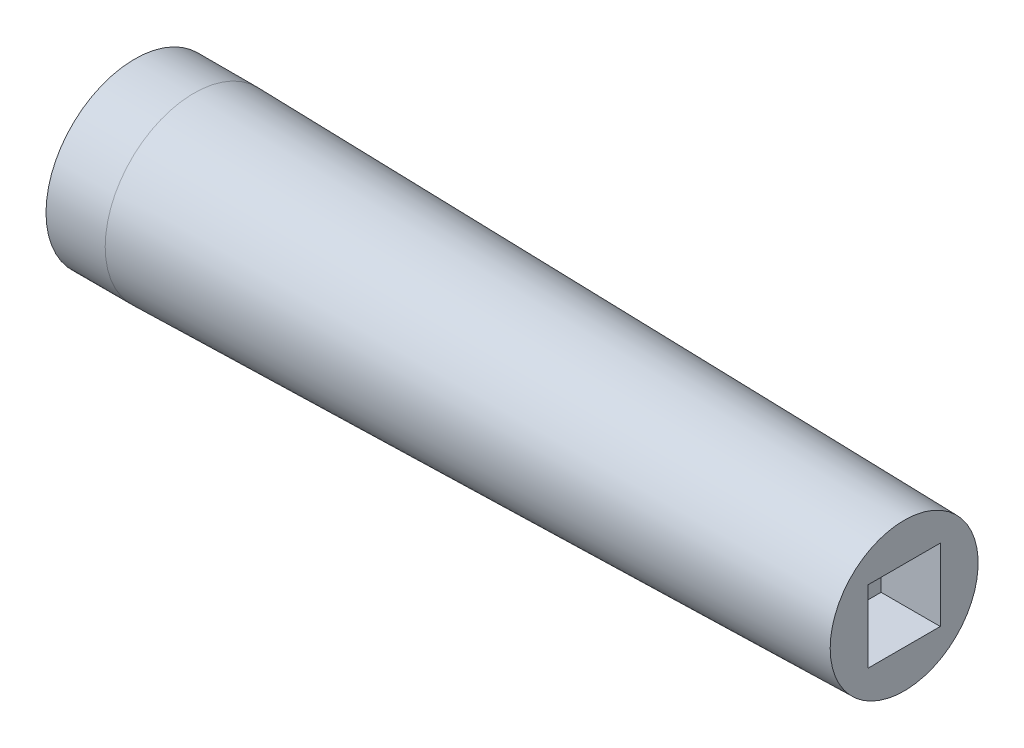
ISO-10303-21;
HEADER;
FILE_DESCRIPTION(('STEP AP214'),'2;1');
FILE_NAME('part.step','',(''),(''),'','','');
FILE_SCHEMA(('AUTOMOTIVE_DESIGN { 1 0 10303 214 1 1 1 1 }'));
ENDSEC;
DATA;
#1=APPLICATION_CONTEXT('core data for automotive mechanical design processes');
#2=APPLICATION_PROTOCOL_DEFINITION('international standard','automotive_design',2000,#1);
#3=PRODUCT_CONTEXT('',#1,'mechanical');
#4=PRODUCT('Part','Part','',(#3));
#5=PRODUCT_RELATED_PRODUCT_CATEGORY('part','',(#4));
#6=PRODUCT_DEFINITION_FORMATION('','',#4);
#7=PRODUCT_DEFINITION_CONTEXT('part definition',#1,'design');
#8=PRODUCT_DEFINITION('design','',#6,#7);
#9=PRODUCT_DEFINITION_SHAPE('','',#8);
#10=(LENGTH_UNIT() NAMED_UNIT(*) SI_UNIT(.MILLI.,.METRE.));
#11=(NAMED_UNIT(*) PLANE_ANGLE_UNIT() SI_UNIT($,.RADIAN.));
#12=(NAMED_UNIT(*) SI_UNIT($,.STERADIAN.) SOLID_ANGLE_UNIT());
#13=UNCERTAINTY_MEASURE_WITH_UNIT(LENGTH_MEASURE(1.E-05),#10,'distance_accuracy_value','');
#14=(GEOMETRIC_REPRESENTATION_CONTEXT(3) GLOBAL_UNCERTAINTY_ASSIGNED_CONTEXT((#13)) GLOBAL_UNIT_ASSIGNED_CONTEXT((#10,
#11,#12)) REPRESENTATION_CONTEXT('',''));
#15=CARTESIAN_POINT('',(0.,0.,0.));
#16=DIRECTION('',(0.,0.,1.));
#17=DIRECTION('',(1.,0.,0.));
#18=AXIS2_PLACEMENT_3D('',#15,#16,#17);
#19=CARTESIAN_POINT('',(0.,19.05,0.));
#20=DIRECTION('',(1.,0.,0.));
#21=DIRECTION('',(0.,0.,-1.));
#22=AXIS2_PLACEMENT_3D('',#19,#20,#21);
#23=PLANE('',#22);
#24=CARTESIAN_POINT('',(0.,0.,0.));
#25=DIRECTION('',(-1.,0.,0.));
#26=DIRECTION('',(0.,0.,1.));
#27=AXIS2_PLACEMENT_3D('',#24,#25,#26);
#28=CIRCLE('',#27,19.05);
#29=CARTESIAN_POINT('',(0.,0.,19.05));
#30=VERTEX_POINT('',#29);
#31=EDGE_CURVE('E108',#30,#30,#28,.T.);
#32=ORIENTED_EDGE('',*,*,#31,.T.);
#33=EDGE_LOOP('',(#32));
#34=FACE_BOUND('',#33,.T.);
#35=ADVANCED_FACE('F33',(#34),#23,.F.);
#36=CARTESIAN_POINT('',(165.1,0.,0.));
#37=DIRECTION('',(-1.,0.,0.));
#38=DIRECTION('',(0.,0.,1.));
#39=AXIS2_PLACEMENT_3D('',#36,#37,#38);
#40=PLANE('',#39);
#41=DIRECTION('',(0.,0.,1.));
#42=VECTOR('',#41,1.);
#43=CARTESIAN_POINT('',(165.1,7.747,7.747));
#44=LINE('',#43,#42);
#45=CARTESIAN_POINT('',(165.1,7.747,-7.747));
#46=VERTEX_POINT('',#45);
#47=CARTESIAN_POINT('',(165.1,7.747,7.747));
#48=VERTEX_POINT('',#47);
#49=EDGE_CURVE('E82',#46,#48,#44,.T.);
#50=ORIENTED_EDGE('',*,*,#49,.F.);
#51=DIRECTION('',(0.,1.,0.));
#52=VECTOR('',#51,1.);
#53=CARTESIAN_POINT('',(165.1,-7.747,-7.747));
#54=LINE('',#53,#52);
#55=CARTESIAN_POINT('',(165.1,-7.747,-7.747));
#56=VERTEX_POINT('',#55);
#57=EDGE_CURVE('E47',#56,#46,#54,.T.);
#58=ORIENTED_EDGE('',*,*,#57,.F.);
#59=DIRECTION('',(0.,0.,-1.));
#60=VECTOR('',#59,1.);
#61=CARTESIAN_POINT('',(165.1,-7.747,7.747));
#62=LINE('',#61,#60);
#63=CARTESIAN_POINT('',(165.1,-7.747,7.747));
#64=VERTEX_POINT('',#63);
#65=EDGE_CURVE('E98',#64,#56,#62,.T.);
#66=ORIENTED_EDGE('',*,*,#65,.F.);
#67=DIRECTION('',(0.,-1.,0.));
#68=VECTOR('',#67,1.);
#69=CARTESIAN_POINT('',(165.1,-7.747,7.747));
#70=LINE('',#69,#68);
#71=EDGE_CURVE('E104',#48,#64,#70,.T.);
#72=ORIENTED_EDGE('',*,*,#71,.F.);
#73=EDGE_LOOP('',(#50,#58,#66,#72));
#74=FACE_BOUND('',#73,.T.);
#75=CARTESIAN_POINT('',(165.1,0.,0.));
#76=DIRECTION('',(-1.,0.,0.));
#77=DIRECTION('',(0.,0.,1.));
#78=AXIS2_PLACEMENT_3D('',#75,#76,#77);
#79=CIRCLE('',#78,15.875);
#80=CARTESIAN_POINT('',(165.1,0.,15.875));
#81=VERTEX_POINT('',#80);
#82=EDGE_CURVE('E11',#81,#81,#79,.T.);
#83=ORIENTED_EDGE('',*,*,#82,.F.);
#84=EDGE_LOOP('',(#83));
#85=FACE_BOUND('',#84,.T.);
#86=ADVANCED_FACE('F120',(#74,#85),#40,.F.);
#87=CARTESIAN_POINT('',(165.1,0.,0.));
#88=DIRECTION('',(-1.,0.,0.));
#89=DIRECTION('',(0.,0.,1.));
#90=AXIS2_PLACEMENT_3D('',#87,#88,#89);
#91=CONICAL_SURFACE('',#90,15.875,0.0208303200362171);
#92=CARTESIAN_POINT('',(12.7,0.,0.));
#93=DIRECTION('',(-1.,0.,0.));
#94=DIRECTION('',(0.,0.,1.));
#95=AXIS2_PLACEMENT_3D('',#92,#93,#94);
#96=CIRCLE('',#95,19.05);
#97=CARTESIAN_POINT('',(12.7,0.,19.05));
#98=VERTEX_POINT('',#97);
#99=EDGE_CURVE('E40',#98,#98,#96,.T.);
#100=ORIENTED_EDGE('',*,*,#99,.F.);
#101=EDGE_LOOP('',(#100));
#102=FACE_BOUND('',#101,.T.);
#103=ORIENTED_EDGE('',*,*,#82,.T.);
#104=EDGE_LOOP('',(#103));
#105=FACE_BOUND('',#104,.T.);
#106=ADVANCED_FACE('F117',(#102,#105),#91,.T.);
#107=CARTESIAN_POINT('',(0.,0.,0.));
#108=DIRECTION('',(-1.,0.,0.));
#109=DIRECTION('',(0.,0.,1.));
#110=AXIS2_PLACEMENT_3D('',#107,#108,#109);
#111=CYLINDRICAL_SURFACE('',#110,19.05);
#112=ORIENTED_EDGE('',*,*,#31,.F.);
#113=EDGE_LOOP('',(#112));
#114=FACE_BOUND('',#113,.T.);
#115=ORIENTED_EDGE('',*,*,#99,.T.);
#116=EDGE_LOOP('',(#115));
#117=FACE_BOUND('',#116,.T.);
#118=ADVANCED_FACE('F115',(#114,#117),#111,.T.);
#119=CARTESIAN_POINT('',(152.4,-7.747,-7.747));
#120=DIRECTION('',(0.,0.,-1.));
#121=DIRECTION('',(-1.,0.,0.));
#122=AXIS2_PLACEMENT_3D('',#119,#120,#121);
#123=PLANE('',#122);
#124=ORIENTED_EDGE('',*,*,#57,.T.);
#125=DIRECTION('',(1.,0.,0.));
#126=VECTOR('',#125,1.);
#127=CARTESIAN_POINT('',(152.4,7.747,-7.747));
#128=LINE('',#127,#126);
#129=CARTESIAN_POINT('',(152.4,7.747,-7.747));
#130=VERTEX_POINT('',#129);
#131=EDGE_CURVE('E70',#130,#46,#128,.T.);
#132=ORIENTED_EDGE('',*,*,#131,.F.);
#133=DIRECTION('',(0.,1.,0.));
#134=VECTOR('',#133,1.);
#135=CARTESIAN_POINT('',(152.4,-7.747,-7.747));
#136=LINE('',#135,#134);
#137=CARTESIAN_POINT('',(152.4,-7.747,-7.747));
#138=VERTEX_POINT('',#137);
#139=EDGE_CURVE('E96',#138,#130,#136,.T.);
#140=ORIENTED_EDGE('',*,*,#139,.F.);
#141=DIRECTION('',(1.,0.,0.));
#142=VECTOR('',#141,1.);
#143=CARTESIAN_POINT('',(152.4,-7.747,-7.747));
#144=LINE('',#143,#142);
#145=EDGE_CURVE('E55',#138,#56,#144,.T.);
#146=ORIENTED_EDGE('',*,*,#145,.T.);
#147=EDGE_LOOP('',(#124,#132,#140,#146));
#148=FACE_BOUND('',#147,.T.);
#149=ADVANCED_FACE('F133',(#148),#123,.F.);
#150=CARTESIAN_POINT('',(152.4,-7.747,7.747));
#151=DIRECTION('',(0.,-1.,0.));
#152=DIRECTION('',(0.,0.,-1.));
#153=AXIS2_PLACEMENT_3D('',#150,#151,#152);
#154=PLANE('',#153);
#155=ORIENTED_EDGE('',*,*,#65,.T.);
#156=ORIENTED_EDGE('',*,*,#145,.F.);
#157=DIRECTION('',(0.,0.,-1.));
#158=VECTOR('',#157,1.);
#159=CARTESIAN_POINT('',(152.4,-7.747,7.747));
#160=LINE('',#159,#158);
#161=CARTESIAN_POINT('',(152.4,-7.747,7.747));
#162=VERTEX_POINT('',#161);
#163=EDGE_CURVE('E93',#162,#138,#160,.T.);
#164=ORIENTED_EDGE('',*,*,#163,.F.);
#165=DIRECTION('',(1.,0.,0.));
#166=VECTOR('',#165,1.);
#167=CARTESIAN_POINT('',(152.4,-7.747,7.747));
#168=LINE('',#167,#166);
#169=EDGE_CURVE('E86',#162,#64,#168,.T.);
#170=ORIENTED_EDGE('',*,*,#169,.T.);
#171=EDGE_LOOP('',(#155,#156,#164,#170));
#172=FACE_BOUND('',#171,.T.);
#173=ADVANCED_FACE('F137',(#172),#154,.F.);
#174=CARTESIAN_POINT('',(152.4,-7.747,7.747));
#175=DIRECTION('',(0.,0.,1.));
#176=DIRECTION('',(1.,0.,0.));
#177=AXIS2_PLACEMENT_3D('',#174,#175,#176);
#178=PLANE('',#177);
#179=ORIENTED_EDGE('',*,*,#71,.T.);
#180=ORIENTED_EDGE('',*,*,#169,.F.);
#181=DIRECTION('',(0.,-1.,0.));
#182=VECTOR('',#181,1.);
#183=CARTESIAN_POINT('',(152.4,-7.747,7.747));
#184=LINE('',#183,#182);
#185=CARTESIAN_POINT('',(152.4,7.747,7.747));
#186=VERTEX_POINT('',#185);
#187=EDGE_CURVE('E89',#186,#162,#184,.T.);
#188=ORIENTED_EDGE('',*,*,#187,.F.);
#189=DIRECTION('',(1.,0.,0.));
#190=VECTOR('',#189,1.);
#191=CARTESIAN_POINT('',(152.4,7.747,7.747));
#192=LINE('',#191,#190);
#193=EDGE_CURVE('E75',#186,#48,#192,.T.);
#194=ORIENTED_EDGE('',*,*,#193,.T.);
#195=EDGE_LOOP('',(#179,#180,#188,#194));
#196=FACE_BOUND('',#195,.T.);
#197=ADVANCED_FACE('F90',(#196),#178,.F.);
#198=CARTESIAN_POINT('',(152.4,7.747,7.747));
#199=DIRECTION('',(0.,1.,0.));
#200=DIRECTION('',(0.,0.,1.));
#201=AXIS2_PLACEMENT_3D('',#198,#199,#200);
#202=PLANE('',#201);
#203=ORIENTED_EDGE('',*,*,#49,.T.);
#204=ORIENTED_EDGE('',*,*,#193,.F.);
#205=DIRECTION('',(0.,0.,1.));
#206=VECTOR('',#205,1.);
#207=CARTESIAN_POINT('',(152.4,7.747,7.747));
#208=LINE('',#207,#206);
#209=EDGE_CURVE('E79',#130,#186,#208,.T.);
#210=ORIENTED_EDGE('',*,*,#209,.F.);
#211=ORIENTED_EDGE('',*,*,#131,.T.);
#212=EDGE_LOOP('',(#203,#204,#210,#211));
#213=FACE_BOUND('',#212,.T.);
#214=ADVANCED_FACE('F77',(#213),#202,.F.);
#215=CARTESIAN_POINT('',(152.4,0.,0.));
#216=DIRECTION('',(-1.,0.,0.));
#217=DIRECTION('',(0.,0.,1.));
#218=AXIS2_PLACEMENT_3D('',#215,#216,#217);
#219=PLANE('',#218);
#220=ORIENTED_EDGE('',*,*,#139,.T.);
#221=ORIENTED_EDGE('',*,*,#209,.T.);
#222=ORIENTED_EDGE('',*,*,#187,.T.);
#223=ORIENTED_EDGE('',*,*,#163,.T.);
#224=EDGE_LOOP('',(#220,#221,#222,#223));
#225=FACE_BOUND('',#224,.T.);
#226=ADVANCED_FACE('F95',(#225),#219,.F.);
#227=CLOSED_SHELL('',(#35,#86,#106,#118,#149,#173,#197,#214,#226));
#228=MANIFOLD_SOLID_BREP('B2',#227);
#229=ADVANCED_BREP_SHAPE_REPRESENTATION('',(#18,#228),#14);
#230=SHAPE_DEFINITION_REPRESENTATION(#9,#229);
ENDSEC;
END-ISO-10303-21;
